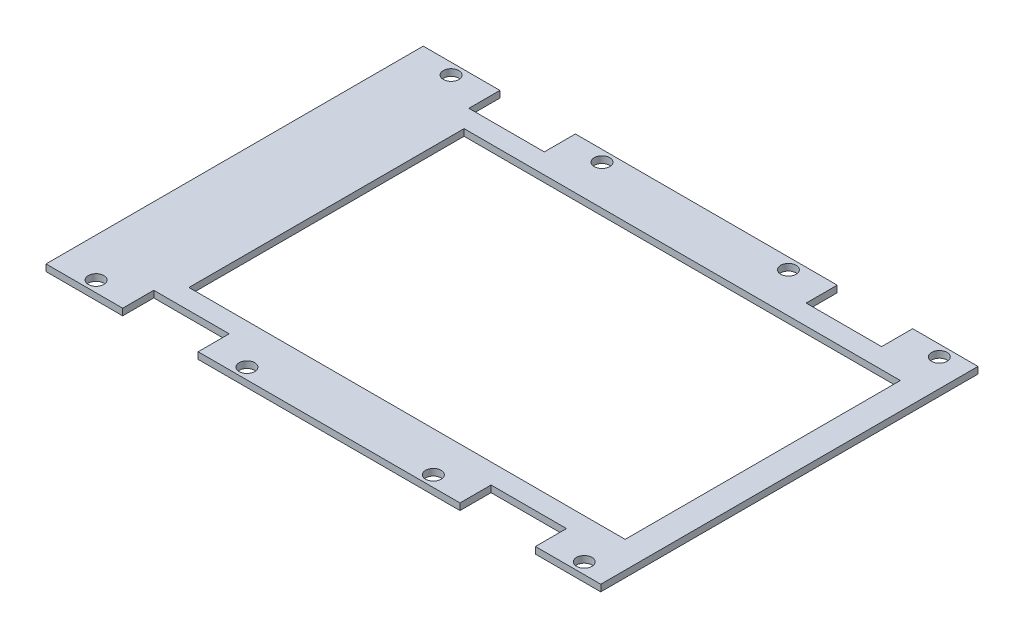
ISO-10303-21;
HEADER;
FILE_DESCRIPTION(('STEP AP214'),'2;1');
FILE_NAME('part.step','',(''),(''),'','','');
FILE_SCHEMA(('AUTOMOTIVE_DESIGN { 1 0 10303 214 1 1 1 1 }'));
ENDSEC;
DATA;
#1=APPLICATION_CONTEXT('core data for automotive mechanical design processes');
#2=APPLICATION_PROTOCOL_DEFINITION('international standard','automotive_design',2000,#1);
#3=PRODUCT_CONTEXT('',#1,'mechanical');
#4=PRODUCT('Part','Part','',(#3));
#5=PRODUCT_RELATED_PRODUCT_CATEGORY('part','',(#4));
#6=PRODUCT_DEFINITION_FORMATION('','',#4);
#7=PRODUCT_DEFINITION_CONTEXT('part definition',#1,'design');
#8=PRODUCT_DEFINITION('design','',#6,#7);
#9=PRODUCT_DEFINITION_SHAPE('','',#8);
#10=(LENGTH_UNIT() NAMED_UNIT(*) SI_UNIT(.MILLI.,.METRE.));
#11=(NAMED_UNIT(*) PLANE_ANGLE_UNIT() SI_UNIT($,.RADIAN.));
#12=(NAMED_UNIT(*) SI_UNIT($,.STERADIAN.) SOLID_ANGLE_UNIT());
#13=UNCERTAINTY_MEASURE_WITH_UNIT(LENGTH_MEASURE(1.E-05),#10,'distance_accuracy_value','');
#14=(GEOMETRIC_REPRESENTATION_CONTEXT(3) GLOBAL_UNCERTAINTY_ASSIGNED_CONTEXT((#13)) GLOBAL_UNIT_ASSIGNED_CONTEXT((#10,
#11,#12)) REPRESENTATION_CONTEXT('',''));
#15=CARTESIAN_POINT('',(0.,0.,0.));
#16=DIRECTION('',(0.,0.,1.));
#17=DIRECTION('',(1.,0.,0.));
#18=AXIS2_PLACEMENT_3D('',#15,#16,#17);
#19=CARTESIAN_POINT('',(-69.85,1.5,-42.5));
#20=DIRECTION('',(0.,0.,1.));
#21=DIRECTION('',(1.,0.,0.));
#22=AXIS2_PLACEMENT_3D('',#19,#20,#21);
#23=PLANE('',#22);
#24=DIRECTION('',(-1.,0.,0.));
#25=VECTOR('',#24,1.);
#26=CARTESIAN_POINT('',(-69.85,1.5,-42.5));
#27=LINE('',#26,#25);
#28=CARTESIAN_POINT('',(23.43,1.5,-42.5));
#29=VERTEX_POINT('',#28);
#30=CARTESIAN_POINT('',(-35.57,1.5,-42.5));
#31=VERTEX_POINT('',#30);
#32=EDGE_CURVE('E369',#29,#31,#27,.T.);
#33=ORIENTED_EDGE('',*,*,#32,.F.);
#34=DIRECTION('',(0.,-1.,0.));
#35=VECTOR('',#34,1.);
#36=CARTESIAN_POINT('',(23.43,1.5,-42.5));
#37=LINE('',#36,#35);
#38=CARTESIAN_POINT('',(23.43,0.,-42.5));
#39=VERTEX_POINT('',#38);
#40=EDGE_CURVE('E223',#29,#39,#37,.T.);
#41=ORIENTED_EDGE('',*,*,#40,.T.);
#42=DIRECTION('',(-1.,0.,0.));
#43=VECTOR('',#42,1.);
#44=CARTESIAN_POINT('',(-69.85,0.,-42.5));
#45=LINE('',#44,#43);
#46=CARTESIAN_POINT('',(-35.57,0.,-42.5));
#47=VERTEX_POINT('',#46);
#48=EDGE_CURVE('E55',#39,#47,#45,.T.);
#49=ORIENTED_EDGE('',*,*,#48,.T.);
#50=DIRECTION('',(0.,1.,0.));
#51=VECTOR('',#50,1.);
#52=CARTESIAN_POINT('',(-35.57,1.5,-42.5));
#53=LINE('',#52,#51);
#54=EDGE_CURVE('E237',#47,#31,#53,.T.);
#55=ORIENTED_EDGE('',*,*,#54,.T.);
#56=EDGE_LOOP('',(#33,#41,#49,#55));
#57=FACE_BOUND('',#56,.T.);
#58=ADVANCED_FACE('F33',(#57),#23,.F.);
#59=CARTESIAN_POINT('',(-52.57,1.5,-42.5));
#60=VERTEX_POINT('',#59);
#61=CARTESIAN_POINT('',(-69.85,1.5,-42.5));
#62=VERTEX_POINT('',#61);
#63=EDGE_CURVE('E364',#60,#62,#27,.T.);
#64=ORIENTED_EDGE('',*,*,#63,.F.);
#65=DIRECTION('',(0.,-1.,0.));
#66=VECTOR('',#65,1.);
#67=CARTESIAN_POINT('',(-52.57,1.5,-42.5));
#68=LINE('',#67,#66);
#69=CARTESIAN_POINT('',(-52.57,0.,-42.5));
#70=VERTEX_POINT('',#69);
#71=EDGE_CURVE('E243',#60,#70,#68,.T.);
#72=ORIENTED_EDGE('',*,*,#71,.T.);
#73=CARTESIAN_POINT('',(-69.85,0.,-42.5));
#74=VERTEX_POINT('',#73);
#75=EDGE_CURVE('E379',#70,#74,#45,.T.);
#76=ORIENTED_EDGE('',*,*,#75,.T.);
#77=DIRECTION('',(0.,-1.,0.));
#78=VECTOR('',#77,1.);
#79=CARTESIAN_POINT('',(-69.85,1.5,-42.5));
#80=LINE('',#79,#78);
#81=EDGE_CURVE('E368',#62,#74,#80,.T.);
#82=ORIENTED_EDGE('',*,*,#81,.F.);
#83=EDGE_LOOP('',(#64,#72,#76,#82));
#84=FACE_BOUND('',#83,.T.);
#85=ADVANCED_FACE('F433',(#84),#23,.F.);
#86=CARTESIAN_POINT('',(-69.85,1.5,42.5));
#87=DIRECTION('',(0.,0.,-1.));
#88=DIRECTION('',(-1.,0.,0.));
#89=AXIS2_PLACEMENT_3D('',#86,#87,#88);
#90=PLANE('',#89);
#91=DIRECTION('',(1.,0.,0.));
#92=VECTOR('',#91,1.);
#93=CARTESIAN_POINT('',(-69.85,0.,42.5));
#94=LINE('',#93,#92);
#95=CARTESIAN_POINT('',(-35.57,0.,42.5));
#96=VERTEX_POINT('',#95);
#97=CARTESIAN_POINT('',(23.43,0.,42.5));
#98=VERTEX_POINT('',#97);
#99=EDGE_CURVE('E377',#96,#98,#94,.T.);
#100=ORIENTED_EDGE('',*,*,#99,.T.);
#101=DIRECTION('',(0.,1.,0.));
#102=VECTOR('',#101,1.);
#103=CARTESIAN_POINT('',(23.43,1.5,42.5));
#104=LINE('',#103,#102);
#105=CARTESIAN_POINT('',(23.43,1.5,42.5));
#106=VERTEX_POINT('',#105);
#107=EDGE_CURVE('E264',#98,#106,#104,.T.);
#108=ORIENTED_EDGE('',*,*,#107,.T.);
#109=DIRECTION('',(1.,0.,0.));
#110=VECTOR('',#109,1.);
#111=CARTESIAN_POINT('',(-69.85,1.5,42.5));
#112=LINE('',#111,#110);
#113=CARTESIAN_POINT('',(-35.57,1.5,42.5));
#114=VERTEX_POINT('',#113);
#115=EDGE_CURVE('E362',#114,#106,#112,.T.);
#116=ORIENTED_EDGE('',*,*,#115,.F.);
#117=DIRECTION('',(0.,-1.,0.));
#118=VECTOR('',#117,1.);
#119=CARTESIAN_POINT('',(-35.57,1.5,42.5));
#120=LINE('',#119,#118);
#121=EDGE_CURVE('E280',#114,#96,#120,.T.);
#122=ORIENTED_EDGE('',*,*,#121,.T.);
#123=EDGE_LOOP('',(#100,#108,#116,#122));
#124=FACE_BOUND('',#123,.T.);
#125=ADVANCED_FACE('F458',(#124),#90,.F.);
#126=CARTESIAN_POINT('',(-69.85,0.,42.5));
#127=VERTEX_POINT('',#126);
#128=CARTESIAN_POINT('',(-52.57,0.,42.5));
#129=VERTEX_POINT('',#128);
#130=EDGE_CURVE('E373',#127,#129,#94,.T.);
#131=ORIENTED_EDGE('',*,*,#130,.T.);
#132=DIRECTION('',(0.,1.,0.));
#133=VECTOR('',#132,1.);
#134=CARTESIAN_POINT('',(-52.57,1.5,42.5));
#135=LINE('',#134,#133);
#136=CARTESIAN_POINT('',(-52.57,1.5,42.5));
#137=VERTEX_POINT('',#136);
#138=EDGE_CURVE('E285',#129,#137,#135,.T.);
#139=ORIENTED_EDGE('',*,*,#138,.T.);
#140=CARTESIAN_POINT('',(-69.85,1.5,42.5));
#141=VERTEX_POINT('',#140);
#142=EDGE_CURVE('E358',#141,#137,#112,.T.);
#143=ORIENTED_EDGE('',*,*,#142,.F.);
#144=DIRECTION('',(0.,-1.,0.));
#145=VECTOR('',#144,1.);
#146=CARTESIAN_POINT('',(-69.85,1.5,42.5));
#147=LINE('',#146,#145);
#148=EDGE_CURVE('E389',#141,#127,#147,.T.);
#149=ORIENTED_EDGE('',*,*,#148,.T.);
#150=EDGE_LOOP('',(#131,#139,#143,#149));
#151=FACE_BOUND('',#150,.T.);
#152=ADVANCED_FACE('F438',(#151),#90,.F.);
#153=CARTESIAN_POINT('',(-69.85,1.5,-42.5));
#154=DIRECTION('',(1.,0.,0.));
#155=DIRECTION('',(0.,0.,-1.));
#156=AXIS2_PLACEMENT_3D('',#153,#154,#155);
#157=PLANE('',#156);
#158=DIRECTION('',(0.,0.,1.));
#159=VECTOR('',#158,1.);
#160=CARTESIAN_POINT('',(-69.85,0.,-42.5));
#161=LINE('',#160,#159);
#162=EDGE_CURVE('E346',#74,#127,#161,.T.);
#163=ORIENTED_EDGE('',*,*,#162,.T.);
#164=ORIENTED_EDGE('',*,*,#148,.F.);
#165=DIRECTION('',(0.,0.,1.));
#166=VECTOR('',#165,1.);
#167=CARTESIAN_POINT('',(-69.85,1.5,-42.5));
#168=LINE('',#167,#166);
#169=EDGE_CURVE('E353',#62,#141,#168,.T.);
#170=ORIENTED_EDGE('',*,*,#169,.F.);
#171=ORIENTED_EDGE('',*,*,#81,.T.);
#172=EDGE_LOOP('',(#163,#164,#170,#171));
#173=FACE_BOUND('',#172,.T.);
#174=ADVANCED_FACE('F35',(#173),#157,.F.);
#175=CARTESIAN_POINT('',(40.43,1.5,42.5));
#176=VERTEX_POINT('',#175);
#177=CARTESIAN_POINT('',(55.15,1.5,42.5));
#178=VERTEX_POINT('',#177);
#179=EDGE_CURVE('E356',#176,#178,#112,.T.);
#180=ORIENTED_EDGE('',*,*,#179,.F.);
#181=DIRECTION('',(0.,-1.,0.));
#182=VECTOR('',#181,1.);
#183=CARTESIAN_POINT('',(40.43,1.5,42.5));
#184=LINE('',#183,#182);
#185=CARTESIAN_POINT('',(40.43,0.,42.5));
#186=VERTEX_POINT('',#185);
#187=EDGE_CURVE('E259',#176,#186,#184,.T.);
#188=ORIENTED_EDGE('',*,*,#187,.T.);
#189=CARTESIAN_POINT('',(55.15,0.,42.5));
#190=VERTEX_POINT('',#189);
#191=EDGE_CURVE('E372',#186,#190,#94,.T.);
#192=ORIENTED_EDGE('',*,*,#191,.T.);
#193=DIRECTION('',(0.,-1.,0.));
#194=VECTOR('',#193,1.);
#195=CARTESIAN_POINT('',(55.15,1.5,42.5));
#196=LINE('',#195,#194);
#197=EDGE_CURVE('E386',#178,#190,#196,.T.);
#198=ORIENTED_EDGE('',*,*,#197,.F.);
#199=EDGE_LOOP('',(#180,#188,#192,#198));
#200=FACE_BOUND('',#199,.T.);
#201=ADVANCED_FACE('F467',(#200),#90,.F.);
#202=CARTESIAN_POINT('',(55.15,1.5,-42.5));
#203=DIRECTION('',(-1.,0.,0.));
#204=DIRECTION('',(0.,0.,1.));
#205=AXIS2_PLACEMENT_3D('',#202,#203,#204);
#206=PLANE('',#205);
#207=DIRECTION('',(0.,0.,-1.));
#208=VECTOR('',#207,1.);
#209=CARTESIAN_POINT('',(55.15,0.,-42.5));
#210=LINE('',#209,#208);
#211=CARTESIAN_POINT('',(55.15,0.,-42.5));
#212=VERTEX_POINT('',#211);
#213=EDGE_CURVE('E376',#190,#212,#210,.T.);
#214=ORIENTED_EDGE('',*,*,#213,.T.);
#215=DIRECTION('',(0.,-1.,0.));
#216=VECTOR('',#215,1.);
#217=CARTESIAN_POINT('',(55.15,1.5,-42.5));
#218=LINE('',#217,#216);
#219=CARTESIAN_POINT('',(55.15,1.5,-42.5));
#220=VERTEX_POINT('',#219);
#221=EDGE_CURVE('E383',#220,#212,#218,.T.);
#222=ORIENTED_EDGE('',*,*,#221,.F.);
#223=DIRECTION('',(0.,0.,-1.));
#224=VECTOR('',#223,1.);
#225=CARTESIAN_POINT('',(55.15,1.5,-42.5));
#226=LINE('',#225,#224);
#227=EDGE_CURVE('E361',#178,#220,#226,.T.);
#228=ORIENTED_EDGE('',*,*,#227,.F.);
#229=ORIENTED_EDGE('',*,*,#197,.T.);
#230=EDGE_LOOP('',(#214,#222,#228,#229));
#231=FACE_BOUND('',#230,.T.);
#232=ADVANCED_FACE('F471',(#231),#206,.F.);
#233=CARTESIAN_POINT('',(40.43,0.,-42.5));
#234=VERTEX_POINT('',#233);
#235=EDGE_CURVE('E357',#212,#234,#45,.T.);
#236=ORIENTED_EDGE('',*,*,#235,.T.);
#237=DIRECTION('',(0.,1.,0.));
#238=VECTOR('',#237,1.);
#239=CARTESIAN_POINT('',(40.43,1.5,-42.5));
#240=LINE('',#239,#238);
#241=CARTESIAN_POINT('',(40.43,1.5,-42.5));
#242=VERTEX_POINT('',#241);
#243=EDGE_CURVE('E48',#234,#242,#240,.T.);
#244=ORIENTED_EDGE('',*,*,#243,.T.);
#245=EDGE_CURVE('E365',#220,#242,#27,.T.);
#246=ORIENTED_EDGE('',*,*,#245,.F.);
#247=ORIENTED_EDGE('',*,*,#221,.T.);
#248=EDGE_LOOP('',(#236,#244,#246,#247));
#249=FACE_BOUND('',#248,.T.);
#250=ADVANCED_FACE('F474',(#249),#23,.F.);
#251=CARTESIAN_POINT('',(0.,1.5,0.));
#252=DIRECTION('',(0.,1.,0.));
#253=DIRECTION('',(0.,0.,1.));
#254=AXIS2_PLACEMENT_3D('',#251,#252,#253);
#255=PLANE('',#254);
#256=DIRECTION('',(0.,0.,1.));
#257=VECTOR('',#256,1.);
#258=CARTESIAN_POINT('',(23.43,1.5,0.));
#259=LINE('',#258,#257);
#260=CARTESIAN_POINT('',(23.43,1.5,-35.5));
#261=VERTEX_POINT('',#260);
#262=EDGE_CURVE('E221',#29,#261,#259,.T.);
#263=ORIENTED_EDGE('',*,*,#262,.F.);
#264=ORIENTED_EDGE('',*,*,#32,.T.);
#265=DIRECTION('',(0.,0.,-1.));
#266=VECTOR('',#265,1.);
#267=CARTESIAN_POINT('',(-35.57,1.5,0.));
#268=LINE('',#267,#266);
#269=CARTESIAN_POINT('',(-35.57,1.5,-35.5));
#270=VERTEX_POINT('',#269);
#271=EDGE_CURVE('E233',#270,#31,#268,.T.);
#272=ORIENTED_EDGE('',*,*,#271,.F.);
#273=DIRECTION('',(1.,0.,0.));
#274=VECTOR('',#273,1.);
#275=CARTESIAN_POINT('',(0.,1.5,-35.5));
#276=LINE('',#275,#274);
#277=CARTESIAN_POINT('',(-52.57,1.5,-35.5));
#278=VERTEX_POINT('',#277);
#279=EDGE_CURVE('E239',#278,#270,#276,.T.);
#280=ORIENTED_EDGE('',*,*,#279,.F.);
#281=DIRECTION('',(0.,0.,1.));
#282=VECTOR('',#281,1.);
#283=CARTESIAN_POINT('',(-52.57,1.5,0.));
#284=LINE('',#283,#282);
#285=EDGE_CURVE('E241',#60,#278,#284,.T.);
#286=ORIENTED_EDGE('',*,*,#285,.F.);
#287=ORIENTED_EDGE('',*,*,#63,.T.);
#288=ORIENTED_EDGE('',*,*,#169,.T.);
#289=ORIENTED_EDGE('',*,*,#142,.T.);
#290=DIRECTION('',(0.,0.,1.));
#291=VECTOR('',#290,1.);
#292=CARTESIAN_POINT('',(-52.5700000000001,1.5,0.));
#293=LINE('',#292,#291);
#294=CARTESIAN_POINT('',(-52.57,1.5,35.5));
#295=VERTEX_POINT('',#294);
#296=EDGE_CURVE('E283',#295,#137,#293,.T.);
#297=ORIENTED_EDGE('',*,*,#296,.F.);
#298=DIRECTION('',(-1.,0.,0.));
#299=VECTOR('',#298,1.);
#300=CARTESIAN_POINT('',(0.,1.5,35.5));
#301=LINE('',#300,#299);
#302=CARTESIAN_POINT('',(-35.57,1.5,35.5));
#303=VERTEX_POINT('',#302);
#304=EDGE_CURVE('E275',#303,#295,#301,.T.);
#305=ORIENTED_EDGE('',*,*,#304,.F.);
#306=DIRECTION('',(0.,0.,-1.));
#307=VECTOR('',#306,1.);
#308=CARTESIAN_POINT('',(-35.57,1.5,0.));
#309=LINE('',#308,#307);
#310=EDGE_CURVE('E278',#114,#303,#309,.T.);
#311=ORIENTED_EDGE('',*,*,#310,.F.);
#312=ORIENTED_EDGE('',*,*,#115,.T.);
#313=DIRECTION('',(0.,0.,1.));
#314=VECTOR('',#313,1.);
#315=CARTESIAN_POINT('',(23.43,1.5,0.));
#316=LINE('',#315,#314);
#317=CARTESIAN_POINT('',(23.43,1.5,35.5));
#318=VERTEX_POINT('',#317);
#319=EDGE_CURVE('E262',#318,#106,#316,.T.);
#320=ORIENTED_EDGE('',*,*,#319,.F.);
#321=DIRECTION('',(-1.,0.,0.));
#322=VECTOR('',#321,1.);
#323=CARTESIAN_POINT('',(0.,1.5,35.5));
#324=LINE('',#323,#322);
#325=CARTESIAN_POINT('',(40.43,1.5,35.5));
#326=VERTEX_POINT('',#325);
#327=EDGE_CURVE('E254',#326,#318,#324,.T.);
#328=ORIENTED_EDGE('',*,*,#327,.F.);
#329=DIRECTION('',(0.,0.,-1.));
#330=VECTOR('',#329,1.);
#331=CARTESIAN_POINT('',(40.43,1.5,0.));
#332=LINE('',#331,#330);
#333=EDGE_CURVE('E257',#176,#326,#332,.T.);
#334=ORIENTED_EDGE('',*,*,#333,.F.);
#335=ORIENTED_EDGE('',*,*,#179,.T.);
#336=ORIENTED_EDGE('',*,*,#227,.T.);
#337=ORIENTED_EDGE('',*,*,#245,.T.);
#338=DIRECTION('',(0.,0.,-1.));
#339=VECTOR('',#338,1.);
#340=CARTESIAN_POINT('',(40.43,1.5,0.));
#341=LINE('',#340,#339);
#342=CARTESIAN_POINT('',(40.43,1.5,-35.5));
#343=VERTEX_POINT('',#342);
#344=EDGE_CURVE('E216',#343,#242,#341,.T.);
#345=ORIENTED_EDGE('',*,*,#344,.F.);
#346=DIRECTION('',(1.,0.,0.));
#347=VECTOR('',#346,1.);
#348=CARTESIAN_POINT('',(0.,1.5,-35.5));
#349=LINE('',#348,#347);
#350=EDGE_CURVE('E203',#261,#343,#349,.T.);
#351=ORIENTED_EDGE('',*,*,#350,.F.);
#352=EDGE_LOOP('',(#263,#264,#272,#280,#286,#287,#288,#289,#297,#305,#311,#312,#320,#328,#334,
#335,#336,#337,#345,#351));
#353=FACE_BOUND('',#352,.T.);
#354=CARTESIAN_POINT('',(14.9299999999963,1.5,-39.999999999996));
#355=DIRECTION('',(0.,1.,0.));
#356=DIRECTION('',(0.,0.,1.));
#357=AXIS2_PLACEMENT_3D('',#354,#355,#356);
#358=CIRCLE('',#357,1.75);
#359=CARTESIAN_POINT('',(14.9299999999963,1.5,-38.249999999996));
#360=VERTEX_POINT('',#359);
#361=EDGE_CURVE('E288',#360,#360,#358,.T.);
#362=ORIENTED_EDGE('',*,*,#361,.F.);
#363=EDGE_LOOP('',(#362));
#364=FACE_BOUND('',#363,.T.);
#365=CARTESIAN_POINT('',(-27.0700000000045,1.5,-39.999999999996));
#366=DIRECTION('',(0.,1.,0.));
#367=DIRECTION('',(0.,0.,1.));
#368=AXIS2_PLACEMENT_3D('',#365,#366,#367);
#369=CIRCLE('',#368,1.75);
#370=CARTESIAN_POINT('',(-27.0700000000045,1.5,-38.249999999996));
#371=VERTEX_POINT('',#370);
#372=EDGE_CURVE('E292',#371,#371,#369,.T.);
#373=ORIENTED_EDGE('',*,*,#372,.F.);
#374=EDGE_LOOP('',(#373));
#375=FACE_BOUND('',#374,.T.);
#376=CARTESIAN_POINT('',(14.93,1.5,39.999999999996));
#377=DIRECTION('',(0.,1.,0.));
#378=DIRECTION('',(0.,0.,1.));
#379=AXIS2_PLACEMENT_3D('',#376,#377,#378);
#380=CIRCLE('',#379,1.75);
#381=CARTESIAN_POINT('',(14.93,1.5,41.749999999996));
#382=VERTEX_POINT('',#381);
#383=EDGE_CURVE('E296',#382,#382,#380,.T.);
#384=ORIENTED_EDGE('',*,*,#383,.F.);
#385=EDGE_LOOP('',(#384));
#386=FACE_BOUND('',#385,.T.);
#387=CARTESIAN_POINT('',(-27.07,1.5,39.999999999996));
#388=DIRECTION('',(0.,1.,0.));
#389=DIRECTION('',(0.,0.,1.));
#390=AXIS2_PLACEMENT_3D('',#387,#388,#389);
#391=CIRCLE('',#390,1.75);
#392=CARTESIAN_POINT('',(-27.07,1.5,41.749999999996));
#393=VERTEX_POINT('',#392);
#394=EDGE_CURVE('E300',#393,#393,#391,.T.);
#395=ORIENTED_EDGE('',*,*,#394,.F.);
#396=EDGE_LOOP('',(#395));
#397=FACE_BOUND('',#396,.T.);
#398=CARTESIAN_POINT('',(-61.07,1.5,40.));
#399=DIRECTION('',(0.,1.,0.));
#400=DIRECTION('',(0.,0.,1.));
#401=AXIS2_PLACEMENT_3D('',#398,#399,#400);
#402=CIRCLE('',#401,1.75);
#403=CARTESIAN_POINT('',(-61.07,1.5,41.75));
#404=VERTEX_POINT('',#403);
#405=EDGE_CURVE('E304',#404,#404,#402,.T.);
#406=ORIENTED_EDGE('',*,*,#405,.F.);
#407=EDGE_LOOP('',(#406));
#408=FACE_BOUND('',#407,.T.);
#409=CARTESIAN_POINT('',(48.93,1.5,40.));
#410=DIRECTION('',(0.,1.,0.));
#411=DIRECTION('',(0.,0.,1.));
#412=AXIS2_PLACEMENT_3D('',#409,#410,#411);
#413=CIRCLE('',#412,1.75);
#414=CARTESIAN_POINT('',(48.93,1.5,41.75));
#415=VERTEX_POINT('',#414);
#416=EDGE_CURVE('E308',#415,#415,#413,.T.);
#417=ORIENTED_EDGE('',*,*,#416,.F.);
#418=EDGE_LOOP('',(#417));
#419=FACE_BOUND('',#418,.T.);
#420=CARTESIAN_POINT('',(48.93,1.5,-40.));
#421=DIRECTION('',(0.,1.,0.));
#422=DIRECTION('',(0.,0.,1.));
#423=AXIS2_PLACEMENT_3D('',#420,#421,#422);
#424=CIRCLE('',#423,1.75);
#425=CARTESIAN_POINT('',(48.93,1.5,-38.25));
#426=VERTEX_POINT('',#425);
#427=EDGE_CURVE('E312',#426,#426,#424,.T.);
#428=ORIENTED_EDGE('',*,*,#427,.F.);
#429=EDGE_LOOP('',(#428));
#430=FACE_BOUND('',#429,.T.);
#431=CARTESIAN_POINT('',(-61.07,1.5,-40.));
#432=DIRECTION('',(0.,1.,0.));
#433=DIRECTION('',(0.,0.,1.));
#434=AXIS2_PLACEMENT_3D('',#431,#432,#433);
#435=CIRCLE('',#434,1.75);
#436=CARTESIAN_POINT('',(-61.07,1.5,-38.25));
#437=VERTEX_POINT('',#436);
#438=EDGE_CURVE('E316',#437,#437,#435,.T.);
#439=ORIENTED_EDGE('',*,*,#438,.F.);
#440=EDGE_LOOP('',(#439));
#441=FACE_BOUND('',#440,.T.);
#442=DIRECTION('',(0.,0.,1.));
#443=VECTOR('',#442,1.);
#444=CARTESIAN_POINT('',(-49.15,1.5,-31.));
#445=LINE('',#444,#443);
#446=CARTESIAN_POINT('',(-49.15,1.5,-31.));
#447=VERTEX_POINT('',#446);
#448=CARTESIAN_POINT('',(-49.15,1.5,31.));
#449=VERTEX_POINT('',#448);
#450=EDGE_CURVE('E334',#447,#449,#445,.T.);
#451=ORIENTED_EDGE('',*,*,#450,.F.);
#452=DIRECTION('',(-1.,0.,0.));
#453=VECTOR('',#452,1.);
#454=CARTESIAN_POINT('',(-49.15,1.5,-31.));
#455=LINE('',#454,#453);
#456=CARTESIAN_POINT('',(49.15,1.5,-31.));
#457=VERTEX_POINT('',#456);
#458=EDGE_CURVE('E324',#457,#447,#455,.T.);
#459=ORIENTED_EDGE('',*,*,#458,.F.);
#460=DIRECTION('',(0.,0.,-1.));
#461=VECTOR('',#460,1.);
#462=CARTESIAN_POINT('',(49.15,1.5,-31.));
#463=LINE('',#462,#461);
#464=CARTESIAN_POINT('',(49.15,1.5,31.));
#465=VERTEX_POINT('',#464);
#466=EDGE_CURVE('E339',#465,#457,#463,.T.);
#467=ORIENTED_EDGE('',*,*,#466,.F.);
#468=DIRECTION('',(1.,0.,0.));
#469=VECTOR('',#468,1.);
#470=CARTESIAN_POINT('',(-49.15,1.5,31.));
#471=LINE('',#470,#469);
#472=EDGE_CURVE('E336',#449,#465,#471,.T.);
#473=ORIENTED_EDGE('',*,*,#472,.F.);
#474=EDGE_LOOP('',(#451,#459,#467,#473));
#475=FACE_BOUND('',#474,.T.);
#476=ADVANCED_FACE('F427',(#353,#364,#375,#386,#397,#408,#419,#430,#441,#475),#255,.T.);
#477=CARTESIAN_POINT('',(0.,0.,0.));
#478=DIRECTION('',(0.,1.,0.));
#479=DIRECTION('',(0.,0.,1.));
#480=AXIS2_PLACEMENT_3D('',#477,#478,#479);
#481=PLANE('',#480);
#482=CARTESIAN_POINT('',(14.9299999999963,0.,-39.999999999996));
#483=DIRECTION('',(0.,1.,0.));
#484=DIRECTION('',(0.,0.,1.));
#485=AXIS2_PLACEMENT_3D('',#482,#483,#484);
#486=CIRCLE('',#485,1.75);
#487=CARTESIAN_POINT('',(14.9299999999963,0.,-38.249999999996));
#488=VERTEX_POINT('',#487);
#489=EDGE_CURVE('E291',#488,#488,#486,.T.);
#490=ORIENTED_EDGE('',*,*,#489,.T.);
#491=EDGE_LOOP('',(#490));
#492=FACE_BOUND('',#491,.T.);
#493=CARTESIAN_POINT('',(-27.0700000000045,0.,-39.999999999996));
#494=DIRECTION('',(0.,1.,0.));
#495=DIRECTION('',(0.,0.,1.));
#496=AXIS2_PLACEMENT_3D('',#493,#494,#495);
#497=CIRCLE('',#496,1.75);
#498=CARTESIAN_POINT('',(-27.0700000000045,0.,-38.249999999996));
#499=VERTEX_POINT('',#498);
#500=EDGE_CURVE('E295',#499,#499,#497,.T.);
#501=ORIENTED_EDGE('',*,*,#500,.T.);
#502=EDGE_LOOP('',(#501));
#503=FACE_BOUND('',#502,.T.);
#504=CARTESIAN_POINT('',(14.93,0.,39.999999999996));
#505=DIRECTION('',(0.,1.,0.));
#506=DIRECTION('',(0.,0.,1.));
#507=AXIS2_PLACEMENT_3D('',#504,#505,#506);
#508=CIRCLE('',#507,1.75);
#509=CARTESIAN_POINT('',(14.93,0.,41.749999999996));
#510=VERTEX_POINT('',#509);
#511=EDGE_CURVE('E299',#510,#510,#508,.T.);
#512=ORIENTED_EDGE('',*,*,#511,.T.);
#513=EDGE_LOOP('',(#512));
#514=FACE_BOUND('',#513,.T.);
#515=CARTESIAN_POINT('',(-27.07,0.,39.999999999996));
#516=DIRECTION('',(0.,1.,0.));
#517=DIRECTION('',(0.,0.,1.));
#518=AXIS2_PLACEMENT_3D('',#515,#516,#517);
#519=CIRCLE('',#518,1.75);
#520=CARTESIAN_POINT('',(-27.07,0.,41.749999999996));
#521=VERTEX_POINT('',#520);
#522=EDGE_CURVE('E303',#521,#521,#519,.T.);
#523=ORIENTED_EDGE('',*,*,#522,.T.);
#524=EDGE_LOOP('',(#523));
#525=FACE_BOUND('',#524,.T.);
#526=CARTESIAN_POINT('',(-61.07,0.,40.));
#527=DIRECTION('',(0.,1.,0.));
#528=DIRECTION('',(0.,0.,1.));
#529=AXIS2_PLACEMENT_3D('',#526,#527,#528);
#530=CIRCLE('',#529,1.75);
#531=CARTESIAN_POINT('',(-61.07,0.,41.75));
#532=VERTEX_POINT('',#531);
#533=EDGE_CURVE('E307',#532,#532,#530,.T.);
#534=ORIENTED_EDGE('',*,*,#533,.T.);
#535=EDGE_LOOP('',(#534));
#536=FACE_BOUND('',#535,.T.);
#537=CARTESIAN_POINT('',(48.93,0.,40.));
#538=DIRECTION('',(0.,1.,0.));
#539=DIRECTION('',(0.,0.,1.));
#540=AXIS2_PLACEMENT_3D('',#537,#538,#539);
#541=CIRCLE('',#540,1.75);
#542=CARTESIAN_POINT('',(48.93,0.,41.75));
#543=VERTEX_POINT('',#542);
#544=EDGE_CURVE('E311',#543,#543,#541,.T.);
#545=ORIENTED_EDGE('',*,*,#544,.T.);
#546=EDGE_LOOP('',(#545));
#547=FACE_BOUND('',#546,.T.);
#548=CARTESIAN_POINT('',(48.93,0.,-40.));
#549=DIRECTION('',(0.,1.,0.));
#550=DIRECTION('',(0.,0.,1.));
#551=AXIS2_PLACEMENT_3D('',#548,#549,#550);
#552=CIRCLE('',#551,1.75);
#553=CARTESIAN_POINT('',(48.93,0.,-38.25));
#554=VERTEX_POINT('',#553);
#555=EDGE_CURVE('E315',#554,#554,#552,.T.);
#556=ORIENTED_EDGE('',*,*,#555,.T.);
#557=EDGE_LOOP('',(#556));
#558=FACE_BOUND('',#557,.T.);
#559=CARTESIAN_POINT('',(-61.07,0.,-40.));
#560=DIRECTION('',(0.,1.,0.));
#561=DIRECTION('',(0.,0.,1.));
#562=AXIS2_PLACEMENT_3D('',#559,#560,#561);
#563=CIRCLE('',#562,1.75);
#564=CARTESIAN_POINT('',(-61.07,0.,-38.25));
#565=VERTEX_POINT('',#564);
#566=EDGE_CURVE('E319',#565,#565,#563,.T.);
#567=ORIENTED_EDGE('',*,*,#566,.T.);
#568=EDGE_LOOP('',(#567));
#569=FACE_BOUND('',#568,.T.);
#570=DIRECTION('',(-1.,0.,0.));
#571=VECTOR('',#570,1.);
#572=CARTESIAN_POINT('',(-49.15,0.,-31.));
#573=LINE('',#572,#571);
#574=CARTESIAN_POINT('',(49.15,0.,-31.));
#575=VERTEX_POINT('',#574);
#576=CARTESIAN_POINT('',(-49.15,0.,-31.));
#577=VERTEX_POINT('',#576);
#578=EDGE_CURVE('E330',#575,#577,#573,.T.);
#579=ORIENTED_EDGE('',*,*,#578,.T.);
#580=DIRECTION('',(0.,0.,1.));
#581=VECTOR('',#580,1.);
#582=CARTESIAN_POINT('',(-49.15,0.,-31.));
#583=LINE('',#582,#581);
#584=CARTESIAN_POINT('',(-49.15,0.,31.));
#585=VERTEX_POINT('',#584);
#586=EDGE_CURVE('E320',#577,#585,#583,.T.);
#587=ORIENTED_EDGE('',*,*,#586,.T.);
#588=DIRECTION('',(1.,0.,0.));
#589=VECTOR('',#588,1.);
#590=CARTESIAN_POINT('',(-49.15,0.,31.));
#591=LINE('',#590,#589);
#592=CARTESIAN_POINT('',(49.15,0.,31.));
#593=VERTEX_POINT('',#592);
#594=EDGE_CURVE('E323',#585,#593,#591,.T.);
#595=ORIENTED_EDGE('',*,*,#594,.T.);
#596=DIRECTION('',(0.,0.,-1.));
#597=VECTOR('',#596,1.);
#598=CARTESIAN_POINT('',(49.15,0.,-31.));
#599=LINE('',#598,#597);
#600=EDGE_CURVE('E327',#593,#575,#599,.T.);
#601=ORIENTED_EDGE('',*,*,#600,.T.);
#602=EDGE_LOOP('',(#579,#587,#595,#601));
#603=FACE_BOUND('',#602,.T.);
#604=ORIENTED_EDGE('',*,*,#48,.F.);
#605=DIRECTION('',(0.,0.,-1.));
#606=VECTOR('',#605,1.);
#607=CARTESIAN_POINT('',(23.43,0.,-35.5));
#608=LINE('',#607,#606);
#609=CARTESIAN_POINT('',(23.43,0.,-35.5));
#610=VERTEX_POINT('',#609);
#611=EDGE_CURVE('E212',#610,#39,#608,.T.);
#612=ORIENTED_EDGE('',*,*,#611,.F.);
#613=DIRECTION('',(-1.,0.,0.));
#614=VECTOR('',#613,1.);
#615=CARTESIAN_POINT('',(23.43,0.,-35.5));
#616=LINE('',#615,#614);
#617=CARTESIAN_POINT('',(40.43,0.,-35.5));
#618=VERTEX_POINT('',#617);
#619=EDGE_CURVE('E200',#618,#610,#616,.T.);
#620=ORIENTED_EDGE('',*,*,#619,.F.);
#621=DIRECTION('',(0.,0.,-1.));
#622=VECTOR('',#621,1.);
#623=CARTESIAN_POINT('',(40.43,0.,0.));
#624=LINE('',#623,#622);
#625=EDGE_CURVE('E11',#618,#234,#624,.T.);
#626=ORIENTED_EDGE('',*,*,#625,.T.);
#627=ORIENTED_EDGE('',*,*,#235,.F.);
#628=ORIENTED_EDGE('',*,*,#213,.F.);
#629=ORIENTED_EDGE('',*,*,#191,.F.);
#630=DIRECTION('',(0.,0.,1.));
#631=VECTOR('',#630,1.);
#632=CARTESIAN_POINT('',(40.43,0.,44.5));
#633=LINE('',#632,#631);
#634=CARTESIAN_POINT('',(40.43,0.,35.5));
#635=VERTEX_POINT('',#634);
#636=EDGE_CURVE('E249',#635,#186,#633,.T.);
#637=ORIENTED_EDGE('',*,*,#636,.F.);
#638=DIRECTION('',(1.,0.,0.));
#639=VECTOR('',#638,1.);
#640=CARTESIAN_POINT('',(23.43,0.,35.5));
#641=LINE('',#640,#639);
#642=CARTESIAN_POINT('',(23.43,0.,35.5));
#643=VERTEX_POINT('',#642);
#644=EDGE_CURVE('E246',#643,#635,#641,.T.);
#645=ORIENTED_EDGE('',*,*,#644,.F.);
#646=DIRECTION('',(0.,0.,1.));
#647=VECTOR('',#646,1.);
#648=CARTESIAN_POINT('',(23.43,0.,0.));
#649=LINE('',#648,#647);
#650=EDGE_CURVE('E411',#643,#98,#649,.T.);
#651=ORIENTED_EDGE('',*,*,#650,.T.);
#652=ORIENTED_EDGE('',*,*,#99,.F.);
#653=DIRECTION('',(0.,0.,1.));
#654=VECTOR('',#653,1.);
#655=CARTESIAN_POINT('',(-35.57,0.,44.5));
#656=LINE('',#655,#654);
#657=CARTESIAN_POINT('',(-35.57,0.,35.5));
#658=VERTEX_POINT('',#657);
#659=EDGE_CURVE('E270',#658,#96,#656,.T.);
#660=ORIENTED_EDGE('',*,*,#659,.F.);
#661=DIRECTION('',(1.,0.,0.));
#662=VECTOR('',#661,1.);
#663=CARTESIAN_POINT('',(-52.57,0.,35.5));
#664=LINE('',#663,#662);
#665=CARTESIAN_POINT('',(-52.57,0.,35.5));
#666=VERTEX_POINT('',#665);
#667=EDGE_CURVE('E267',#666,#658,#664,.T.);
#668=ORIENTED_EDGE('',*,*,#667,.F.);
#669=DIRECTION('',(0.,0.,1.));
#670=VECTOR('',#669,1.);
#671=CARTESIAN_POINT('',(-52.5700000000001,0.,0.));
#672=LINE('',#671,#670);
#673=EDGE_CURVE('E392',#666,#129,#672,.T.);
#674=ORIENTED_EDGE('',*,*,#673,.T.);
#675=ORIENTED_EDGE('',*,*,#130,.F.);
#676=ORIENTED_EDGE('',*,*,#162,.F.);
#677=ORIENTED_EDGE('',*,*,#75,.F.);
#678=DIRECTION('',(0.,0.,-1.));
#679=VECTOR('',#678,1.);
#680=CARTESIAN_POINT('',(-52.57,0.,-35.5));
#681=LINE('',#680,#679);
#682=CARTESIAN_POINT('',(-52.57,0.,-35.5));
#683=VERTEX_POINT('',#682);
#684=EDGE_CURVE('E225',#683,#70,#681,.T.);
#685=ORIENTED_EDGE('',*,*,#684,.F.);
#686=DIRECTION('',(-1.,0.,0.));
#687=VECTOR('',#686,1.);
#688=CARTESIAN_POINT('',(-52.57,0.,-35.5));
#689=LINE('',#688,#687);
#690=CARTESIAN_POINT('',(-35.57,0.,-35.5));
#691=VERTEX_POINT('',#690);
#692=EDGE_CURVE('E227',#691,#683,#689,.T.);
#693=ORIENTED_EDGE('',*,*,#692,.F.);
#694=DIRECTION('',(0.,0.,-1.));
#695=VECTOR('',#694,1.);
#696=CARTESIAN_POINT('',(-35.57,0.,0.));
#697=LINE('',#696,#695);
#698=EDGE_CURVE('E41',#691,#47,#697,.T.);
#699=ORIENTED_EDGE('',*,*,#698,.T.);
#700=EDGE_LOOP('',(#604,#612,#620,#626,#627,#628,#629,#637,#645,#651,#652,#660,#668,#674,#675,
#676,#677,#685,#693,#699));
#701=FACE_BOUND('',#700,.T.);
#702=ADVANCED_FACE('F211',(#492,#503,#514,#525,#536,#547,#558,#569,#603,#701),#481,.F.);
#703=CARTESIAN_POINT('',(-49.15,0.,-31.));
#704=DIRECTION('',(-1.,0.,0.));
#705=DIRECTION('',(0.,0.,1.));
#706=AXIS2_PLACEMENT_3D('',#703,#704,#705);
#707=PLANE('',#706);
#708=ORIENTED_EDGE('',*,*,#450,.T.);
#709=DIRECTION('',(0.,1.,0.));
#710=VECTOR('',#709,1.);
#711=CARTESIAN_POINT('',(-49.15,0.,31.));
#712=LINE('',#711,#710);
#713=EDGE_CURVE('E333',#585,#449,#712,.T.);
#714=ORIENTED_EDGE('',*,*,#713,.F.);
#715=ORIENTED_EDGE('',*,*,#586,.F.);
#716=DIRECTION('',(0.,1.,0.));
#717=VECTOR('',#716,1.);
#718=CARTESIAN_POINT('',(-49.15,0.,-31.));
#719=LINE('',#718,#717);
#720=EDGE_CURVE('E344',#577,#447,#719,.T.);
#721=ORIENTED_EDGE('',*,*,#720,.T.);
#722=EDGE_LOOP('',(#708,#714,#715,#721));
#723=FACE_BOUND('',#722,.T.);
#724=ADVANCED_FACE('F725',(#723),#707,.F.);
#725=CARTESIAN_POINT('',(-49.15,0.,-31.));
#726=DIRECTION('',(0.,0.,-1.));
#727=DIRECTION('',(-1.,0.,0.));
#728=AXIS2_PLACEMENT_3D('',#725,#726,#727);
#729=PLANE('',#728);
#730=ORIENTED_EDGE('',*,*,#458,.T.);
#731=ORIENTED_EDGE('',*,*,#720,.F.);
#732=ORIENTED_EDGE('',*,*,#578,.F.);
#733=DIRECTION('',(0.,1.,0.));
#734=VECTOR('',#733,1.);
#735=CARTESIAN_POINT('',(49.15,0.,-31.));
#736=LINE('',#735,#734);
#737=EDGE_CURVE('E347',#575,#457,#736,.T.);
#738=ORIENTED_EDGE('',*,*,#737,.T.);
#739=EDGE_LOOP('',(#730,#731,#732,#738));
#740=FACE_BOUND('',#739,.T.);
#741=ADVANCED_FACE('F715',(#740),#729,.F.);
#742=CARTESIAN_POINT('',(49.15,0.,-31.));
#743=DIRECTION('',(1.,0.,0.));
#744=DIRECTION('',(0.,0.,-1.));
#745=AXIS2_PLACEMENT_3D('',#742,#743,#744);
#746=PLANE('',#745);
#747=ORIENTED_EDGE('',*,*,#466,.T.);
#748=ORIENTED_EDGE('',*,*,#737,.F.);
#749=ORIENTED_EDGE('',*,*,#600,.F.);
#750=DIRECTION('',(0.,1.,0.));
#751=VECTOR('',#750,1.);
#752=CARTESIAN_POINT('',(49.15,0.,31.));
#753=LINE('',#752,#751);
#754=EDGE_CURVE('E349',#593,#465,#753,.T.);
#755=ORIENTED_EDGE('',*,*,#754,.T.);
#756=EDGE_LOOP('',(#747,#748,#749,#755));
#757=FACE_BOUND('',#756,.T.);
#758=ADVANCED_FACE('F705',(#757),#746,.F.);
#759=CARTESIAN_POINT('',(-49.15,0.,31.));
#760=DIRECTION('',(0.,0.,1.));
#761=DIRECTION('',(1.,0.,0.));
#762=AXIS2_PLACEMENT_3D('',#759,#760,#761);
#763=PLANE('',#762);
#764=ORIENTED_EDGE('',*,*,#472,.T.);
#765=ORIENTED_EDGE('',*,*,#754,.F.);
#766=ORIENTED_EDGE('',*,*,#594,.F.);
#767=ORIENTED_EDGE('',*,*,#713,.T.);
#768=EDGE_LOOP('',(#764,#765,#766,#767));
#769=FACE_BOUND('',#768,.T.);
#770=ADVANCED_FACE('F695',(#769),#763,.F.);
#771=CARTESIAN_POINT('',(-61.07,-8.5,-40.));
#772=DIRECTION('',(0.,1.,0.));
#773=DIRECTION('',(0.,0.,1.));
#774=AXIS2_PLACEMENT_3D('',#771,#772,#773);
#775=CYLINDRICAL_SURFACE('',#774,1.75);
#776=ORIENTED_EDGE('',*,*,#438,.T.);
#777=EDGE_LOOP('',(#776));
#778=FACE_BOUND('',#777,.T.);
#779=ORIENTED_EDGE('',*,*,#566,.F.);
#780=EDGE_LOOP('',(#779));
#781=FACE_BOUND('',#780,.T.);
#782=ADVANCED_FACE('F685',(#778,#781),#775,.F.);
#783=CARTESIAN_POINT('',(48.93,-8.5,-40.));
#784=DIRECTION('',(0.,1.,0.));
#785=DIRECTION('',(0.,0.,1.));
#786=AXIS2_PLACEMENT_3D('',#783,#784,#785);
#787=CYLINDRICAL_SURFACE('',#786,1.75);
#788=ORIENTED_EDGE('',*,*,#427,.T.);
#789=EDGE_LOOP('',(#788));
#790=FACE_BOUND('',#789,.T.);
#791=ORIENTED_EDGE('',*,*,#555,.F.);
#792=EDGE_LOOP('',(#791));
#793=FACE_BOUND('',#792,.T.);
#794=ADVANCED_FACE('F675',(#790,#793),#787,.F.);
#795=CARTESIAN_POINT('',(48.93,-8.5,40.));
#796=DIRECTION('',(0.,1.,0.));
#797=DIRECTION('',(0.,0.,1.));
#798=AXIS2_PLACEMENT_3D('',#795,#796,#797);
#799=CYLINDRICAL_SURFACE('',#798,1.75);
#800=ORIENTED_EDGE('',*,*,#416,.T.);
#801=EDGE_LOOP('',(#800));
#802=FACE_BOUND('',#801,.T.);
#803=ORIENTED_EDGE('',*,*,#544,.F.);
#804=EDGE_LOOP('',(#803));
#805=FACE_BOUND('',#804,.T.);
#806=ADVANCED_FACE('F665',(#802,#805),#799,.F.);
#807=CARTESIAN_POINT('',(-61.07,-8.5,40.));
#808=DIRECTION('',(0.,1.,0.));
#809=DIRECTION('',(0.,0.,1.));
#810=AXIS2_PLACEMENT_3D('',#807,#808,#809);
#811=CYLINDRICAL_SURFACE('',#810,1.75);
#812=ORIENTED_EDGE('',*,*,#405,.T.);
#813=EDGE_LOOP('',(#812));
#814=FACE_BOUND('',#813,.T.);
#815=ORIENTED_EDGE('',*,*,#533,.F.);
#816=EDGE_LOOP('',(#815));
#817=FACE_BOUND('',#816,.T.);
#818=ADVANCED_FACE('F653',(#814,#817),#811,.F.);
#819=CARTESIAN_POINT('',(-27.07,-8.5,39.999999999996));
#820=DIRECTION('',(0.,1.,0.));
#821=DIRECTION('',(0.,0.,1.));
#822=AXIS2_PLACEMENT_3D('',#819,#820,#821);
#823=CYLINDRICAL_SURFACE('',#822,1.75);
#824=ORIENTED_EDGE('',*,*,#394,.T.);
#825=EDGE_LOOP('',(#824));
#826=FACE_BOUND('',#825,.T.);
#827=ORIENTED_EDGE('',*,*,#522,.F.);
#828=EDGE_LOOP('',(#827));
#829=FACE_BOUND('',#828,.T.);
#830=ADVANCED_FACE('F646',(#826,#829),#823,.F.);
#831=CARTESIAN_POINT('',(14.93,-8.5,39.999999999996));
#832=DIRECTION('',(0.,1.,0.));
#833=DIRECTION('',(0.,0.,1.));
#834=AXIS2_PLACEMENT_3D('',#831,#832,#833);
#835=CYLINDRICAL_SURFACE('',#834,1.75);
#836=ORIENTED_EDGE('',*,*,#383,.T.);
#837=EDGE_LOOP('',(#836));
#838=FACE_BOUND('',#837,.T.);
#839=ORIENTED_EDGE('',*,*,#511,.F.);
#840=EDGE_LOOP('',(#839));
#841=FACE_BOUND('',#840,.T.);
#842=ADVANCED_FACE('F639',(#838,#841),#835,.F.);
#843=CARTESIAN_POINT('',(-27.0700000000045,-8.5,-39.999999999996));
#844=DIRECTION('',(0.,1.,0.));
#845=DIRECTION('',(0.,0.,1.));
#846=AXIS2_PLACEMENT_3D('',#843,#844,#845);
#847=CYLINDRICAL_SURFACE('',#846,1.75);
#848=ORIENTED_EDGE('',*,*,#372,.T.);
#849=EDGE_LOOP('',(#848));
#850=FACE_BOUND('',#849,.T.);
#851=ORIENTED_EDGE('',*,*,#500,.F.);
#852=EDGE_LOOP('',(#851));
#853=FACE_BOUND('',#852,.T.);
#854=ADVANCED_FACE('F632',(#850,#853),#847,.F.);
#855=CARTESIAN_POINT('',(14.9299999999963,-8.5,-39.999999999996));
#856=DIRECTION('',(0.,1.,0.));
#857=DIRECTION('',(0.,0.,1.));
#858=AXIS2_PLACEMENT_3D('',#855,#856,#857);
#859=CYLINDRICAL_SURFACE('',#858,1.75);
#860=ORIENTED_EDGE('',*,*,#361,.T.);
#861=EDGE_LOOP('',(#860));
#862=FACE_BOUND('',#861,.T.);
#863=ORIENTED_EDGE('',*,*,#489,.F.);
#864=EDGE_LOOP('',(#863));
#865=FACE_BOUND('',#864,.T.);
#866=ADVANCED_FACE('F537',(#862,#865),#859,.F.);
#867=CARTESIAN_POINT('',(-52.57,10.,44.5));
#868=DIRECTION('',(-1.,0.,0.));
#869=DIRECTION('',(0.,0.,1.));
#870=AXIS2_PLACEMENT_3D('',#867,#868,#869);
#871=PLANE('',#870);
#872=ORIENTED_EDGE('',*,*,#673,.F.);
#873=DIRECTION('',(0.,-1.,0.));
#874=VECTOR('',#873,1.);
#875=CARTESIAN_POINT('',(-52.57,10.,35.5));
#876=LINE('',#875,#874);
#877=EDGE_CURVE('E272',#295,#666,#876,.T.);
#878=ORIENTED_EDGE('',*,*,#877,.F.);
#879=ORIENTED_EDGE('',*,*,#296,.T.);
#880=ORIENTED_EDGE('',*,*,#138,.F.);
#881=EDGE_LOOP('',(#872,#878,#879,#880));
#882=FACE_BOUND('',#881,.T.);
#883=ADVANCED_FACE('F445',(#882),#871,.F.);
#884=CARTESIAN_POINT('',(-35.57,10.,44.5));
#885=DIRECTION('',(1.,0.,0.));
#886=DIRECTION('',(0.,0.,-1.));
#887=AXIS2_PLACEMENT_3D('',#884,#885,#886);
#888=PLANE('',#887);
#889=ORIENTED_EDGE('',*,*,#310,.T.);
#890=DIRECTION('',(0.,-1.,0.));
#891=VECTOR('',#890,1.);
#892=CARTESIAN_POINT('',(-35.57,10.,35.5));
#893=LINE('',#892,#891);
#894=EDGE_CURVE('E273',#303,#658,#893,.T.);
#895=ORIENTED_EDGE('',*,*,#894,.T.);
#896=ORIENTED_EDGE('',*,*,#659,.T.);
#897=ORIENTED_EDGE('',*,*,#121,.F.);
#898=EDGE_LOOP('',(#889,#895,#896,#897));
#899=FACE_BOUND('',#898,.T.);
#900=ADVANCED_FACE('F452',(#899),#888,.F.);
#901=CARTESIAN_POINT('',(-52.57,10.,35.5));
#902=DIRECTION('',(0.,0.,-1.));
#903=DIRECTION('',(-1.,0.,0.));
#904=AXIS2_PLACEMENT_3D('',#901,#902,#903);
#905=PLANE('',#904);
#906=ORIENTED_EDGE('',*,*,#304,.T.);
#907=ORIENTED_EDGE('',*,*,#877,.T.);
#908=ORIENTED_EDGE('',*,*,#667,.T.);
#909=ORIENTED_EDGE('',*,*,#894,.F.);
#910=EDGE_LOOP('',(#906,#907,#908,#909));
#911=FACE_BOUND('',#910,.T.);
#912=ADVANCED_FACE('F448',(#911),#905,.F.);
#913=CARTESIAN_POINT('',(23.43,10.,44.5));
#914=DIRECTION('',(-1.,0.,0.));
#915=DIRECTION('',(0.,0.,1.));
#916=AXIS2_PLACEMENT_3D('',#913,#914,#915);
#917=PLANE('',#916);
#918=ORIENTED_EDGE('',*,*,#650,.F.);
#919=DIRECTION('',(0.,-1.,0.));
#920=VECTOR('',#919,1.);
#921=CARTESIAN_POINT('',(23.43,10.,35.5));
#922=LINE('',#921,#920);
#923=EDGE_CURVE('E251',#318,#643,#922,.T.);
#924=ORIENTED_EDGE('',*,*,#923,.F.);
#925=ORIENTED_EDGE('',*,*,#319,.T.);
#926=ORIENTED_EDGE('',*,*,#107,.F.);
#927=EDGE_LOOP('',(#918,#924,#925,#926));
#928=FACE_BOUND('',#927,.T.);
#929=ADVANCED_FACE('F553',(#928),#917,.F.);
#930=CARTESIAN_POINT('',(40.43,10.,44.5));
#931=DIRECTION('',(1.,0.,0.));
#932=DIRECTION('',(0.,0.,-1.));
#933=AXIS2_PLACEMENT_3D('',#930,#931,#932);
#934=PLANE('',#933);
#935=ORIENTED_EDGE('',*,*,#333,.T.);
#936=DIRECTION('',(0.,-1.,0.));
#937=VECTOR('',#936,1.);
#938=CARTESIAN_POINT('',(40.43,10.,35.5));
#939=LINE('',#938,#937);
#940=EDGE_CURVE('E252',#326,#635,#939,.T.);
#941=ORIENTED_EDGE('',*,*,#940,.T.);
#942=ORIENTED_EDGE('',*,*,#636,.T.);
#943=ORIENTED_EDGE('',*,*,#187,.F.);
#944=EDGE_LOOP('',(#935,#941,#942,#943));
#945=FACE_BOUND('',#944,.T.);
#946=ADVANCED_FACE('F561',(#945),#934,.F.);
#947=CARTESIAN_POINT('',(23.43,10.,35.5));
#948=DIRECTION('',(0.,0.,-1.));
#949=DIRECTION('',(-1.,0.,0.));
#950=AXIS2_PLACEMENT_3D('',#947,#948,#949);
#951=PLANE('',#950);
#952=ORIENTED_EDGE('',*,*,#327,.T.);
#953=ORIENTED_EDGE('',*,*,#923,.T.);
#954=ORIENTED_EDGE('',*,*,#644,.T.);
#955=ORIENTED_EDGE('',*,*,#940,.F.);
#956=EDGE_LOOP('',(#952,#953,#954,#955));
#957=FACE_BOUND('',#956,.T.);
#958=ADVANCED_FACE('F570',(#957),#951,.F.);
#959=CARTESIAN_POINT('',(-52.57,10.,-35.5));
#960=DIRECTION('',(-1.,0.,0.));
#961=DIRECTION('',(0.,0.,1.));
#962=AXIS2_PLACEMENT_3D('',#959,#960,#961);
#963=PLANE('',#962);
#964=ORIENTED_EDGE('',*,*,#285,.T.);
#965=DIRECTION('',(0.,-1.,0.));
#966=VECTOR('',#965,1.);
#967=CARTESIAN_POINT('',(-52.57,10.,-35.5));
#968=LINE('',#967,#966);
#969=EDGE_CURVE('E231',#278,#683,#968,.T.);
#970=ORIENTED_EDGE('',*,*,#969,.T.);
#971=ORIENTED_EDGE('',*,*,#684,.T.);
#972=ORIENTED_EDGE('',*,*,#71,.F.);
#973=EDGE_LOOP('',(#964,#970,#971,#972));
#974=FACE_BOUND('',#973,.T.);
#975=ADVANCED_FACE('F579',(#974),#963,.F.);
#976=CARTESIAN_POINT('',(-35.57,10.,-35.5));
#977=DIRECTION('',(1.,0.,0.));
#978=DIRECTION('',(0.,0.,-1.));
#979=AXIS2_PLACEMENT_3D('',#976,#977,#978);
#980=PLANE('',#979);
#981=ORIENTED_EDGE('',*,*,#698,.F.);
#982=DIRECTION('',(0.,-1.,0.));
#983=VECTOR('',#982,1.);
#984=CARTESIAN_POINT('',(-35.57,10.,-35.5));
#985=LINE('',#984,#983);
#986=EDGE_CURVE('E230',#270,#691,#985,.T.);
#987=ORIENTED_EDGE('',*,*,#986,.F.);
#988=ORIENTED_EDGE('',*,*,#271,.T.);
#989=ORIENTED_EDGE('',*,*,#54,.F.);
#990=EDGE_LOOP('',(#981,#987,#988,#989));
#991=FACE_BOUND('',#990,.T.);
#992=ADVANCED_FACE('F419',(#991),#980,.F.);
#993=CARTESIAN_POINT('',(-52.57,10.,-35.5));
#994=DIRECTION('',(0.,0.,1.));
#995=DIRECTION('',(1.,0.,0.));
#996=AXIS2_PLACEMENT_3D('',#993,#994,#995);
#997=PLANE('',#996);
#998=ORIENTED_EDGE('',*,*,#279,.T.);
#999=ORIENTED_EDGE('',*,*,#986,.T.);
#1000=ORIENTED_EDGE('',*,*,#692,.T.);
#1001=ORIENTED_EDGE('',*,*,#969,.F.);
#1002=EDGE_LOOP('',(#998,#999,#1000,#1001));
#1003=FACE_BOUND('',#1002,.T.);
#1004=ADVANCED_FACE('F478',(#1003),#997,.F.);
#1005=CARTESIAN_POINT('',(23.43,10.,-35.5));
#1006=DIRECTION('',(-1.,0.,0.));
#1007=DIRECTION('',(0.,0.,1.));
#1008=AXIS2_PLACEMENT_3D('',#1005,#1006,#1007);
#1009=PLANE('',#1008);
#1010=ORIENTED_EDGE('',*,*,#262,.T.);
#1011=DIRECTION('',(0.,-1.,0.));
#1012=VECTOR('',#1011,1.);
#1013=CARTESIAN_POINT('',(23.43,10.,-35.5));
#1014=LINE('',#1013,#1012);
#1015=EDGE_CURVE('E205',#261,#610,#1014,.T.);
#1016=ORIENTED_EDGE('',*,*,#1015,.T.);
#1017=ORIENTED_EDGE('',*,*,#611,.T.);
#1018=ORIENTED_EDGE('',*,*,#40,.F.);
#1019=EDGE_LOOP('',(#1010,#1016,#1017,#1018));
#1020=FACE_BOUND('',#1019,.T.);
#1021=ADVANCED_FACE('F476',(#1020),#1009,.F.);
#1022=CARTESIAN_POINT('',(40.43,10.,-35.5));
#1023=DIRECTION('',(1.,0.,0.));
#1024=DIRECTION('',(0.,0.,-1.));
#1025=AXIS2_PLACEMENT_3D('',#1022,#1023,#1024);
#1026=PLANE('',#1025);
#1027=ORIENTED_EDGE('',*,*,#625,.F.);
#1028=DIRECTION('',(0.,-1.,0.));
#1029=VECTOR('',#1028,1.);
#1030=CARTESIAN_POINT('',(40.43,10.,-35.5));
#1031=LINE('',#1030,#1029);
#1032=EDGE_CURVE('E196',#343,#618,#1031,.T.);
#1033=ORIENTED_EDGE('',*,*,#1032,.F.);
#1034=ORIENTED_EDGE('',*,*,#344,.T.);
#1035=ORIENTED_EDGE('',*,*,#243,.F.);
#1036=EDGE_LOOP('',(#1027,#1033,#1034,#1035));
#1037=FACE_BOUND('',#1036,.T.);
#1038=ADVANCED_FACE('F207',(#1037),#1026,.F.);
#1039=CARTESIAN_POINT('',(23.43,10.,-35.5));
#1040=DIRECTION('',(0.,0.,1.));
#1041=DIRECTION('',(1.,0.,0.));
#1042=AXIS2_PLACEMENT_3D('',#1039,#1040,#1041);
#1043=PLANE('',#1042);
#1044=ORIENTED_EDGE('',*,*,#350,.T.);
#1045=ORIENTED_EDGE('',*,*,#1032,.T.);
#1046=ORIENTED_EDGE('',*,*,#619,.T.);
#1047=ORIENTED_EDGE('',*,*,#1015,.F.);
#1048=EDGE_LOOP('',(#1044,#1045,#1046,#1047));
#1049=FACE_BOUND('',#1048,.T.);
#1050=ADVANCED_FACE('F197',(#1049),#1043,.F.);
#1051=CLOSED_SHELL('',(#58,#85,#125,#152,#174,#201,#232,#250,#476,#702,#724,#741,#758,#770,#782,
#794,#806,#818,#830,#842,#854,#866,#883,#900,#912,#929,#946,#958,#975,#992,#1004,#1021,#1038,#1050));
#1052=MANIFOLD_SOLID_BREP('B2',#1051);
#1053=ADVANCED_BREP_SHAPE_REPRESENTATION('',(#18,#1052),#14);
#1054=SHAPE_DEFINITION_REPRESENTATION(#9,#1053);
ENDSEC;
END-ISO-10303-21;
